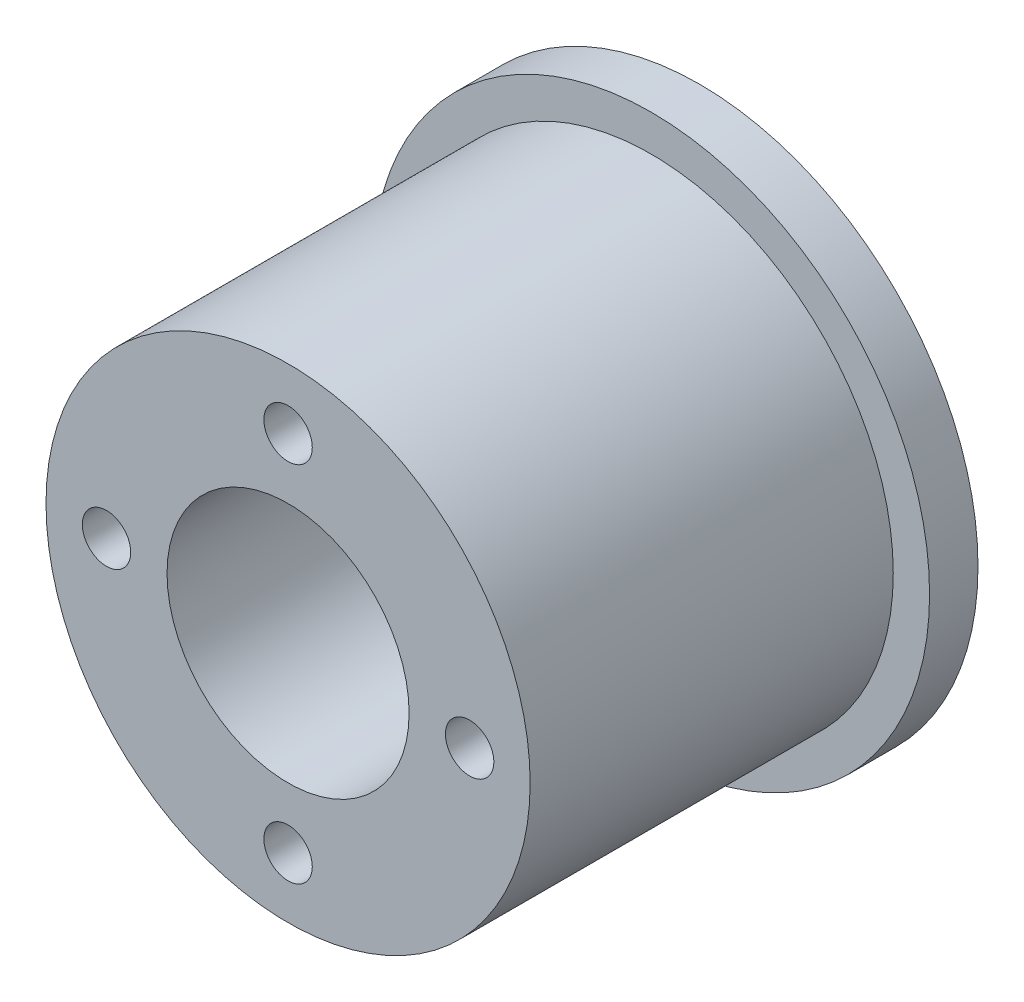
ISO-10303-21;
HEADER;
FILE_DESCRIPTION(('STEP AP214'),'2;1');
FILE_NAME('part.step','',(''),(''),'','','');
FILE_SCHEMA(('AUTOMOTIVE_DESIGN { 1 0 10303 214 1 1 1 1 }'));
ENDSEC;
DATA;
#1=APPLICATION_CONTEXT('core data for automotive mechanical design processes');
#2=APPLICATION_PROTOCOL_DEFINITION('international standard','automotive_design',2000,#1);
#3=PRODUCT_CONTEXT('',#1,'mechanical');
#4=PRODUCT('Part','Part','',(#3));
#5=PRODUCT_RELATED_PRODUCT_CATEGORY('part','',(#4));
#6=PRODUCT_DEFINITION_FORMATION('','',#4);
#7=PRODUCT_DEFINITION_CONTEXT('part definition',#1,'design');
#8=PRODUCT_DEFINITION('design','',#6,#7);
#9=PRODUCT_DEFINITION_SHAPE('','',#8);
#10=(LENGTH_UNIT() NAMED_UNIT(*) SI_UNIT(.MILLI.,.METRE.));
#11=(NAMED_UNIT(*) PLANE_ANGLE_UNIT() SI_UNIT($,.RADIAN.));
#12=(NAMED_UNIT(*) SI_UNIT($,.STERADIAN.) SOLID_ANGLE_UNIT());
#13=UNCERTAINTY_MEASURE_WITH_UNIT(LENGTH_MEASURE(1.E-05),#10,'distance_accuracy_value','');
#14=(GEOMETRIC_REPRESENTATION_CONTEXT(3) GLOBAL_UNCERTAINTY_ASSIGNED_CONTEXT((#13)) GLOBAL_UNIT_ASSIGNED_CONTEXT((#10,
#11,#12)) REPRESENTATION_CONTEXT('',''));
#15=CARTESIAN_POINT('',(0.,0.,0.));
#16=DIRECTION('',(0.,0.,1.));
#17=DIRECTION('',(1.,0.,0.));
#18=AXIS2_PLACEMENT_3D('',#15,#16,#17);
#19=CARTESIAN_POINT('',(0.,0.,4.));
#20=DIRECTION('',(0.,0.,1.));
#21=DIRECTION('',(1.,0.,0.));
#22=AXIS2_PLACEMENT_3D('',#19,#20,#21);
#23=PLANE('',#22);
#24=CARTESIAN_POINT('',(0.,0.,4.));
#25=DIRECTION('',(0.,0.,1.));
#26=DIRECTION('',(1.,0.,0.));
#27=AXIS2_PLACEMENT_3D('',#24,#25,#26);
#28=CIRCLE('',#27,20.);
#29=CARTESIAN_POINT('',(20.,0.,4.));
#30=VERTEX_POINT('',#29);
#31=EDGE_CURVE('E10',#30,#30,#28,.T.);
#32=ORIENTED_EDGE('',*,*,#31,.F.);
#33=EDGE_LOOP('',(#32));
#34=FACE_BOUND('',#33,.T.);
#35=CARTESIAN_POINT('',(0.,0.,4.));
#36=DIRECTION('',(0.,0.,1.));
#37=DIRECTION('',(1.,0.,0.));
#38=AXIS2_PLACEMENT_3D('',#35,#36,#37);
#39=CIRCLE('',#38,23.);
#40=CARTESIAN_POINT('',(23.,0.,4.));
#41=VERTEX_POINT('',#40);
#42=EDGE_CURVE('E47',#41,#41,#39,.T.);
#43=ORIENTED_EDGE('',*,*,#42,.T.);
#44=EDGE_LOOP('',(#43));
#45=FACE_BOUND('',#44,.T.);
#46=ADVANCED_FACE('F39',(#34,#45),#23,.T.);
#47=CARTESIAN_POINT('',(0.,0.,0.));
#48=DIRECTION('',(0.,0.,1.));
#49=DIRECTION('',(1.,0.,0.));
#50=AXIS2_PLACEMENT_3D('',#47,#48,#49);
#51=PLANE('',#50);
#52=CARTESIAN_POINT('',(0.,0.,0.));
#53=DIRECTION('',(0.,0.,1.));
#54=DIRECTION('',(1.,0.,0.));
#55=AXIS2_PLACEMENT_3D('',#52,#53,#54);
#56=CIRCLE('',#55,23.);
#57=CARTESIAN_POINT('',(23.,0.,0.));
#58=VERTEX_POINT('',#57);
#59=EDGE_CURVE('E43',#58,#58,#56,.T.);
#60=ORIENTED_EDGE('',*,*,#59,.F.);
#61=EDGE_LOOP('',(#60));
#62=FACE_BOUND('',#61,.T.);
#63=CARTESIAN_POINT('',(0.,0.,0.));
#64=DIRECTION('',(0.,0.,1.));
#65=DIRECTION('',(1.,0.,0.));
#66=AXIS2_PLACEMENT_3D('',#63,#64,#65);
#67=CIRCLE('',#66,10.);
#68=CARTESIAN_POINT('',(10.,0.,0.));
#69=VERTEX_POINT('',#68);
#70=EDGE_CURVE('E56',#69,#69,#67,.T.);
#71=ORIENTED_EDGE('',*,*,#70,.T.);
#72=EDGE_LOOP('',(#71));
#73=FACE_BOUND('',#72,.T.);
#74=ADVANCED_FACE('F116',(#62,#73),#51,.F.);
#75=CARTESIAN_POINT('',(0.,0.,4.));
#76=DIRECTION('',(0.,0.,-1.));
#77=DIRECTION('',(-1.,0.,0.));
#78=AXIS2_PLACEMENT_3D('',#75,#76,#77);
#79=CYLINDRICAL_SURFACE('',#78,23.);
#80=ORIENTED_EDGE('',*,*,#42,.F.);
#81=EDGE_LOOP('',(#80));
#82=FACE_BOUND('',#81,.T.);
#83=ORIENTED_EDGE('',*,*,#59,.T.);
#84=EDGE_LOOP('',(#83));
#85=FACE_BOUND('',#84,.T.);
#86=ADVANCED_FACE('F41',(#82,#85),#79,.T.);
#87=CARTESIAN_POINT('',(0.,0.,4.));
#88=DIRECTION('',(0.,0.,-1.));
#89=DIRECTION('',(-1.,0.,0.));
#90=AXIS2_PLACEMENT_3D('',#87,#88,#89);
#91=CYLINDRICAL_SURFACE('',#90,10.);
#92=ORIENTED_EDGE('',*,*,#70,.F.);
#93=EDGE_LOOP('',(#92));
#94=FACE_BOUND('',#93,.T.);
#95=CARTESIAN_POINT('',(0.,0.,34.));
#96=DIRECTION('',(0.,0.,1.));
#97=DIRECTION('',(1.,0.,0.));
#98=AXIS2_PLACEMENT_3D('',#95,#96,#97);
#99=CIRCLE('',#98,10.);
#100=CARTESIAN_POINT('',(10.,0.,34.));
#101=VERTEX_POINT('',#100);
#102=EDGE_CURVE('E62',#101,#101,#99,.T.);
#103=ORIENTED_EDGE('',*,*,#102,.T.);
#104=EDGE_LOOP('',(#103));
#105=FACE_BOUND('',#104,.T.);
#106=ADVANCED_FACE('F100',(#94,#105),#91,.F.);
#107=CARTESIAN_POINT('',(0.,0.,34.));
#108=DIRECTION('',(0.,0.,1.));
#109=DIRECTION('',(1.,0.,0.));
#110=AXIS2_PLACEMENT_3D('',#107,#108,#109);
#111=PLANE('',#110);
#112=CARTESIAN_POINT('',(0.,-15.,34.));
#113=DIRECTION('',(0.,0.,1.));
#114=DIRECTION('',(1.,0.,0.));
#115=AXIS2_PLACEMENT_3D('',#112,#113,#114);
#116=CIRCLE('',#115,2.);
#117=CARTESIAN_POINT('',(2.,-15.,34.));
#118=VERTEX_POINT('',#117);
#119=EDGE_CURVE('E79',#118,#118,#116,.T.);
#120=ORIENTED_EDGE('',*,*,#119,.F.);
#121=EDGE_LOOP('',(#120));
#122=FACE_BOUND('',#121,.T.);
#123=CARTESIAN_POINT('',(0.,15.,34.));
#124=DIRECTION('',(0.,0.,1.));
#125=DIRECTION('',(1.,0.,0.));
#126=AXIS2_PLACEMENT_3D('',#123,#124,#125);
#127=CIRCLE('',#126,2.);
#128=CARTESIAN_POINT('',(2.,15.,34.));
#129=VERTEX_POINT('',#128);
#130=EDGE_CURVE('E66',#129,#129,#127,.T.);
#131=ORIENTED_EDGE('',*,*,#130,.F.);
#132=EDGE_LOOP('',(#131));
#133=FACE_BOUND('',#132,.T.);
#134=CARTESIAN_POINT('',(0.,0.,34.));
#135=DIRECTION('',(0.,0.,1.));
#136=DIRECTION('',(1.,0.,0.));
#137=AXIS2_PLACEMENT_3D('',#134,#135,#136);
#138=CIRCLE('',#137,20.);
#139=CARTESIAN_POINT('',(20.,0.,34.));
#140=VERTEX_POINT('',#139);
#141=EDGE_CURVE('E54',#140,#140,#138,.T.);
#142=ORIENTED_EDGE('',*,*,#141,.T.);
#143=EDGE_LOOP('',(#142));
#144=FACE_BOUND('',#143,.T.);
#145=ORIENTED_EDGE('',*,*,#102,.F.);
#146=EDGE_LOOP('',(#145));
#147=FACE_BOUND('',#146,.T.);
#148=CARTESIAN_POINT('',(15.,0.,34.));
#149=DIRECTION('',(0.,0.,1.));
#150=DIRECTION('',(1.,0.,0.));
#151=AXIS2_PLACEMENT_3D('',#148,#149,#150);
#152=CIRCLE('',#151,2.);
#153=CARTESIAN_POINT('',(17.,0.,34.));
#154=VERTEX_POINT('',#153);
#155=EDGE_CURVE('E74',#154,#154,#152,.T.);
#156=ORIENTED_EDGE('',*,*,#155,.F.);
#157=EDGE_LOOP('',(#156));
#158=FACE_BOUND('',#157,.T.);
#159=CARTESIAN_POINT('',(-15.,0.,34.));
#160=DIRECTION('',(0.,0.,1.));
#161=DIRECTION('',(1.,0.,0.));
#162=AXIS2_PLACEMENT_3D('',#159,#160,#161);
#163=CIRCLE('',#162,2.);
#164=CARTESIAN_POINT('',(-13.,0.,34.));
#165=VERTEX_POINT('',#164);
#166=EDGE_CURVE('E85',#165,#165,#163,.T.);
#167=ORIENTED_EDGE('',*,*,#166,.F.);
#168=EDGE_LOOP('',(#167));
#169=FACE_BOUND('',#168,.T.);
#170=ADVANCED_FACE('F97',(#122,#133,#144,#147,#158,#169),#111,.T.);
#171=CARTESIAN_POINT('',(0.,0.,34.));
#172=DIRECTION('',(0.,0.,-1.));
#173=DIRECTION('',(-1.,0.,0.));
#174=AXIS2_PLACEMENT_3D('',#171,#172,#173);
#175=CYLINDRICAL_SURFACE('',#174,20.);
#176=ORIENTED_EDGE('',*,*,#141,.F.);
#177=EDGE_LOOP('',(#176));
#178=FACE_BOUND('',#177,.T.);
#179=ORIENTED_EDGE('',*,*,#31,.T.);
#180=EDGE_LOOP('',(#179));
#181=FACE_BOUND('',#180,.T.);
#182=ADVANCED_FACE('F99',(#178,#181),#175,.T.);
#183=CARTESIAN_POINT('',(0.,15.,34.));
#184=DIRECTION('',(0.,0.,-1.));
#185=DIRECTION('',(-1.,0.,0.));
#186=AXIS2_PLACEMENT_3D('',#183,#184,#185);
#187=CYLINDRICAL_SURFACE('',#186,2.);
#188=ORIENTED_EDGE('',*,*,#130,.T.);
#189=EDGE_LOOP('',(#188));
#190=FACE_BOUND('',#189,.T.);
#191=CARTESIAN_POINT('',(0.,15.,4.));
#192=DIRECTION('',(0.,0.,1.));
#193=DIRECTION('',(1.,0.,0.));
#194=AXIS2_PLACEMENT_3D('',#191,#192,#193);
#195=CIRCLE('',#194,2.);
#196=CARTESIAN_POINT('',(2.,15.,4.));
#197=VERTEX_POINT('',#196);
#198=EDGE_CURVE('E70',#197,#197,#195,.T.);
#199=ORIENTED_EDGE('',*,*,#198,.F.);
#200=EDGE_LOOP('',(#199));
#201=FACE_BOUND('',#200,.T.);
#202=ADVANCED_FACE('F107',(#190,#201),#187,.F.);
#203=CARTESIAN_POINT('',(15.,0.,34.));
#204=DIRECTION('',(0.,0.,-1.));
#205=DIRECTION('',(-1.,0.,0.));
#206=AXIS2_PLACEMENT_3D('',#203,#204,#205);
#207=CYLINDRICAL_SURFACE('',#206,2.);
#208=ORIENTED_EDGE('',*,*,#155,.T.);
#209=EDGE_LOOP('',(#208));
#210=FACE_BOUND('',#209,.T.);
#211=CARTESIAN_POINT('',(15.,0.,4.));
#212=DIRECTION('',(0.,0.,1.));
#213=DIRECTION('',(1.,0.,0.));
#214=AXIS2_PLACEMENT_3D('',#211,#212,#213);
#215=CIRCLE('',#214,2.);
#216=CARTESIAN_POINT('',(17.,0.,4.));
#217=VERTEX_POINT('',#216);
#218=EDGE_CURVE('E76',#217,#217,#215,.T.);
#219=ORIENTED_EDGE('',*,*,#218,.F.);
#220=EDGE_LOOP('',(#219));
#221=FACE_BOUND('',#220,.T.);
#222=ADVANCED_FACE('F147',(#210,#221),#207,.F.);
#223=CARTESIAN_POINT('',(0.,-15.,34.));
#224=DIRECTION('',(0.,0.,-1.));
#225=DIRECTION('',(-1.,0.,0.));
#226=AXIS2_PLACEMENT_3D('',#223,#224,#225);
#227=CYLINDRICAL_SURFACE('',#226,2.);
#228=ORIENTED_EDGE('',*,*,#119,.T.);
#229=EDGE_LOOP('',(#228));
#230=FACE_BOUND('',#229,.T.);
#231=CARTESIAN_POINT('',(0.,-15.,4.));
#232=DIRECTION('',(0.,0.,1.));
#233=DIRECTION('',(1.,0.,0.));
#234=AXIS2_PLACEMENT_3D('',#231,#232,#233);
#235=CIRCLE('',#234,2.);
#236=CARTESIAN_POINT('',(2.,-15.,4.));
#237=VERTEX_POINT('',#236);
#238=EDGE_CURVE('E82',#237,#237,#235,.T.);
#239=ORIENTED_EDGE('',*,*,#238,.F.);
#240=EDGE_LOOP('',(#239));
#241=FACE_BOUND('',#240,.T.);
#242=ADVANCED_FACE('F142',(#230,#241),#227,.F.);
#243=CARTESIAN_POINT('',(-15.,0.,34.));
#244=DIRECTION('',(0.,0.,-1.));
#245=DIRECTION('',(-1.,0.,0.));
#246=AXIS2_PLACEMENT_3D('',#243,#244,#245);
#247=CYLINDRICAL_SURFACE('',#246,2.);
#248=ORIENTED_EDGE('',*,*,#166,.T.);
#249=EDGE_LOOP('',(#248));
#250=FACE_BOUND('',#249,.T.);
#251=CARTESIAN_POINT('',(-15.,0.,4.));
#252=DIRECTION('',(0.,0.,1.));
#253=DIRECTION('',(1.,0.,0.));
#254=AXIS2_PLACEMENT_3D('',#251,#252,#253);
#255=CIRCLE('',#254,2.);
#256=CARTESIAN_POINT('',(-13.,0.,4.));
#257=VERTEX_POINT('',#256);
#258=EDGE_CURVE('E88',#257,#257,#255,.T.);
#259=ORIENTED_EDGE('',*,*,#258,.F.);
#260=EDGE_LOOP('',(#259));
#261=FACE_BOUND('',#260,.T.);
#262=ADVANCED_FACE('F94',(#250,#261),#247,.F.);
#263=ORIENTED_EDGE('',*,*,#238,.T.);
#264=EDGE_LOOP('',(#263));
#265=FACE_BOUND('',#264,.T.);
#266=ADVANCED_FACE('F132',(#265),#23,.T.);
#267=ORIENTED_EDGE('',*,*,#218,.T.);
#268=EDGE_LOOP('',(#267));
#269=FACE_BOUND('',#268,.T.);
#270=ADVANCED_FACE('F128',(#269),#23,.T.);
#271=ORIENTED_EDGE('',*,*,#198,.T.);
#272=EDGE_LOOP('',(#271));
#273=FACE_BOUND('',#272,.T.);
#274=ADVANCED_FACE('F119',(#273),#23,.T.);
#275=ORIENTED_EDGE('',*,*,#258,.T.);
#276=EDGE_LOOP('',(#275));
#277=FACE_BOUND('',#276,.T.);
#278=ADVANCED_FACE('F120',(#277),#23,.T.);
#279=CLOSED_SHELL('',(#46,#74,#86,#106,#170,#182,#202,#222,#242,#262,#266,#270,#274,#278));
#280=MANIFOLD_SOLID_BREP('B2',#279);
#281=ADVANCED_BREP_SHAPE_REPRESENTATION('',(#18,#280),#14);
#282=SHAPE_DEFINITION_REPRESENTATION(#9,#281);
ENDSEC;
END-ISO-10303-21;
